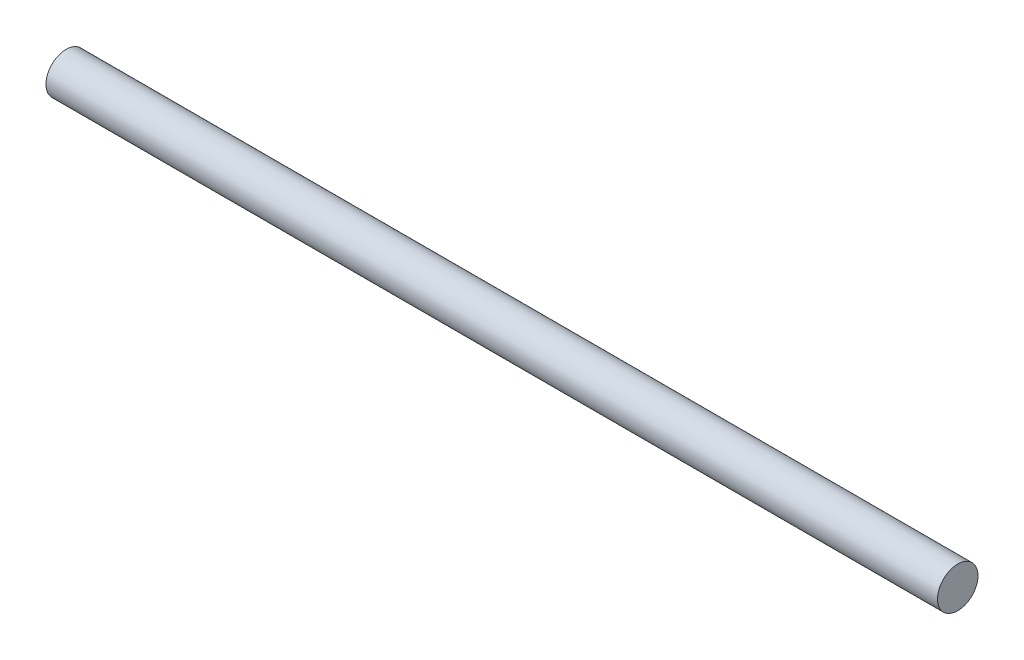
ISO-10303-21;
HEADER;
FILE_DESCRIPTION(('STEP AP214'),'2;1');
FILE_NAME('part.step','',(''),(''),'','','');
FILE_SCHEMA(('AUTOMOTIVE_DESIGN { 1 0 10303 214 1 1 1 1 }'));
ENDSEC;
DATA;
#1=APPLICATION_CONTEXT('core data for automotive mechanical design processes');
#2=APPLICATION_PROTOCOL_DEFINITION('international standard','automotive_design',2000,#1);
#3=PRODUCT_CONTEXT('',#1,'mechanical');
#4=PRODUCT('Part','Part','',(#3));
#5=PRODUCT_RELATED_PRODUCT_CATEGORY('part','',(#4));
#6=PRODUCT_DEFINITION_FORMATION('','',#4);
#7=PRODUCT_DEFINITION_CONTEXT('part definition',#1,'design');
#8=PRODUCT_DEFINITION('design','',#6,#7);
#9=PRODUCT_DEFINITION_SHAPE('','',#8);
#10=(LENGTH_UNIT() NAMED_UNIT(*) SI_UNIT(.MILLI.,.METRE.));
#11=(NAMED_UNIT(*) PLANE_ANGLE_UNIT() SI_UNIT($,.RADIAN.));
#12=(NAMED_UNIT(*) SI_UNIT($,.STERADIAN.) SOLID_ANGLE_UNIT());
#13=UNCERTAINTY_MEASURE_WITH_UNIT(LENGTH_MEASURE(1.E-05),#10,'distance_accuracy_value','');
#14=(GEOMETRIC_REPRESENTATION_CONTEXT(3) GLOBAL_UNCERTAINTY_ASSIGNED_CONTEXT((#13)) GLOBAL_UNIT_ASSIGNED_CONTEXT((#10,
#11,#12)) REPRESENTATION_CONTEXT('',''));
#15=CARTESIAN_POINT('',(0.,0.,0.));
#16=DIRECTION('',(0.,0.,1.));
#17=DIRECTION('',(1.,0.,0.));
#18=AXIS2_PLACEMENT_3D('',#15,#16,#17);
#19=CARTESIAN_POINT('',(139.7,0.,0.));
#20=DIRECTION('',(-1.,0.,0.));
#21=DIRECTION('',(0.,0.,1.));
#22=AXIS2_PLACEMENT_3D('',#19,#20,#21);
#23=CYLINDRICAL_SURFACE('',#22,6.35);
#24=CARTESIAN_POINT('',(139.7,0.,0.));
#25=DIRECTION('',(1.,0.,0.));
#26=DIRECTION('',(0.,0.,-1.));
#27=AXIS2_PLACEMENT_3D('',#24,#25,#26);
#28=CIRCLE('',#27,6.35);
#29=CARTESIAN_POINT('',(139.7,0.,-6.35));
#30=VERTEX_POINT('',#29);
#31=EDGE_CURVE('E10',#30,#30,#28,.T.);
#32=ORIENTED_EDGE('',*,*,#31,.F.);
#33=EDGE_LOOP('',(#32));
#34=FACE_BOUND('',#33,.T.);
#35=CARTESIAN_POINT('',(-139.7,0.,0.));
#36=DIRECTION('',(1.,0.,0.));
#37=DIRECTION('',(0.,0.,-1.));
#38=AXIS2_PLACEMENT_3D('',#35,#36,#37);
#39=CIRCLE('',#38,6.35);
#40=CARTESIAN_POINT('',(-139.7,0.,-6.35));
#41=VERTEX_POINT('',#40);
#42=EDGE_CURVE('E34',#41,#41,#39,.T.);
#43=ORIENTED_EDGE('',*,*,#42,.T.);
#44=EDGE_LOOP('',(#43));
#45=FACE_BOUND('',#44,.T.);
#46=ADVANCED_FACE('F31',(#34,#45),#23,.T.);
#47=CARTESIAN_POINT('',(139.7,0.,0.));
#48=DIRECTION('',(1.,0.,0.));
#49=DIRECTION('',(0.,0.,-1.));
#50=AXIS2_PLACEMENT_3D('',#47,#48,#49);
#51=PLANE('',#50);
#52=ORIENTED_EDGE('',*,*,#31,.T.);
#53=EDGE_LOOP('',(#52));
#54=FACE_BOUND('',#53,.T.);
#55=ADVANCED_FACE('F46',(#54),#51,.T.);
#56=CARTESIAN_POINT('',(-139.7,0.,0.));
#57=DIRECTION('',(1.,0.,0.));
#58=DIRECTION('',(0.,0.,-1.));
#59=AXIS2_PLACEMENT_3D('',#56,#57,#58);
#60=PLANE('',#59);
#61=ORIENTED_EDGE('',*,*,#42,.F.);
#62=EDGE_LOOP('',(#61));
#63=FACE_BOUND('',#62,.T.);
#64=ADVANCED_FACE('F44',(#63),#60,.F.);
#65=CLOSED_SHELL('',(#46,#55,#64));
#66=MANIFOLD_SOLID_BREP('B2',#65);
#67=ADVANCED_BREP_SHAPE_REPRESENTATION('',(#18,#66),#14);
#68=SHAPE_DEFINITION_REPRESENTATION(#9,#67);
ENDSEC;
END-ISO-10303-21;
